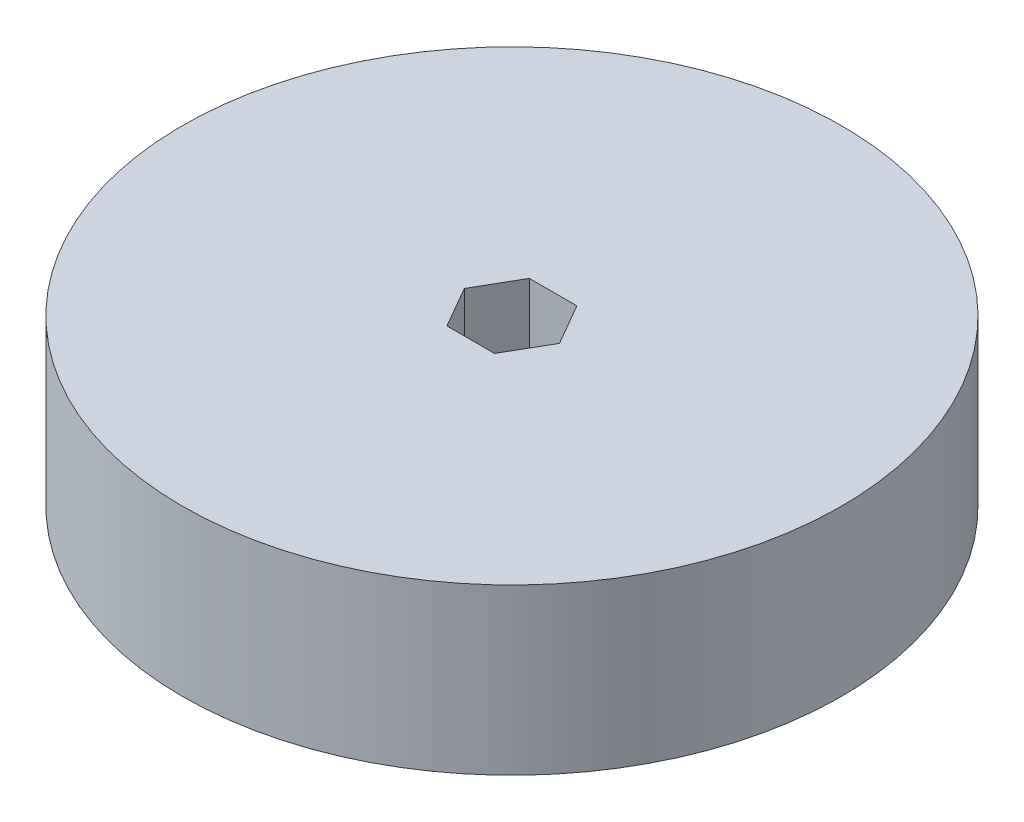
ISO-10303-21;
HEADER;
FILE_DESCRIPTION(('STEP AP214'),'2;1');
FILE_NAME('part.step','',(''),(''),'','','');
FILE_SCHEMA(('AUTOMOTIVE_DESIGN { 1 0 10303 214 1 1 1 1 }'));
ENDSEC;
DATA;
#1=APPLICATION_CONTEXT('core data for automotive mechanical design processes');
#2=APPLICATION_PROTOCOL_DEFINITION('international standard','automotive_design',2000,#1);
#3=PRODUCT_CONTEXT('',#1,'mechanical');
#4=PRODUCT('Part','Part','',(#3));
#5=PRODUCT_RELATED_PRODUCT_CATEGORY('part','',(#4));
#6=PRODUCT_DEFINITION_FORMATION('','',#4);
#7=PRODUCT_DEFINITION_CONTEXT('part definition',#1,'design');
#8=PRODUCT_DEFINITION('design','',#6,#7);
#9=PRODUCT_DEFINITION_SHAPE('','',#8);
#10=(LENGTH_UNIT() NAMED_UNIT(*) SI_UNIT(.MILLI.,.METRE.));
#11=(NAMED_UNIT(*) PLANE_ANGLE_UNIT() SI_UNIT($,.RADIAN.));
#12=(NAMED_UNIT(*) SI_UNIT($,.STERADIAN.) SOLID_ANGLE_UNIT());
#13=UNCERTAINTY_MEASURE_WITH_UNIT(LENGTH_MEASURE(1.E-05),#10,'distance_accuracy_value','');
#14=(GEOMETRIC_REPRESENTATION_CONTEXT(3) GLOBAL_UNCERTAINTY_ASSIGNED_CONTEXT((#13)) GLOBAL_UNIT_ASSIGNED_CONTEXT((#10,
#11,#12)) REPRESENTATION_CONTEXT('',''));
#15=CARTESIAN_POINT('',(0.,0.,0.));
#16=DIRECTION('',(0.,0.,1.));
#17=DIRECTION('',(1.,0.,0.));
#18=AXIS2_PLACEMENT_3D('',#15,#16,#17);
#19=CARTESIAN_POINT('',(0.,25.4,0.));
#20=DIRECTION('',(0.,1.,0.));
#21=DIRECTION('',(0.,0.,1.));
#22=AXIS2_PLACEMENT_3D('',#19,#20,#21);
#23=PLANE('',#22);
#24=CARTESIAN_POINT('',(0.,25.4,0.));
#25=DIRECTION('',(0.,1.,0.));
#26=DIRECTION('',(0.,0.,1.));
#27=AXIS2_PLACEMENT_3D('',#24,#25,#26);
#28=CIRCLE('',#27,50.8);
#29=CARTESIAN_POINT('',(0.,25.4,50.8));
#30=VERTEX_POINT('',#29);
#31=EDGE_CURVE('E11',#30,#30,#28,.T.);
#32=ORIENTED_EDGE('',*,*,#31,.T.);
#33=EDGE_LOOP('',(#32));
#34=FACE_BOUND('',#33,.T.);
#35=DIRECTION('',(-0.500000000000001,0.,-0.866025403784438));
#36=VECTOR('',#35,1.);
#37=CARTESIAN_POINT('',(7.33234841870825,25.4,0.));
#38=LINE('',#37,#36);
#39=CARTESIAN_POINT('',(7.33234841870825,25.4,0.));
#40=VERTEX_POINT('',#39);
#41=CARTESIAN_POINT('',(3.66617420935411,25.4,-6.35000000000001));
#42=VERTEX_POINT('',#41);
#43=EDGE_CURVE('E108',#40,#42,#38,.T.);
#44=ORIENTED_EDGE('',*,*,#43,.F.);
#45=DIRECTION('',(0.499999999999995,0.,-0.866025403784441));
#46=VECTOR('',#45,1.);
#47=CARTESIAN_POINT('',(3.6661742093542,25.4,6.34999999999996));
#48=LINE('',#47,#46);
#49=CARTESIAN_POINT('',(3.6661742093542,25.4,6.34999999999996));
#50=VERTEX_POINT('',#49);
#51=EDGE_CURVE('E99',#50,#40,#48,.T.);
#52=ORIENTED_EDGE('',*,*,#51,.F.);
#53=DIRECTION('',(1.,0.,0.));
#54=VECTOR('',#53,1.);
#55=CARTESIAN_POINT('',(-3.66617420935407,25.4,6.35000000000004));
#56=LINE('',#55,#54);
#57=CARTESIAN_POINT('',(-3.66617420935407,25.4,6.35000000000004));
#58=VERTEX_POINT('',#57);
#59=EDGE_CURVE('E133',#58,#50,#56,.T.);
#60=ORIENTED_EDGE('',*,*,#59,.F.);
#61=DIRECTION('',(0.500000000000007,0.,0.866025403784434));
#62=VECTOR('',#61,1.);
#63=CARTESIAN_POINT('',(-7.33234841870825,25.4,0.));
#64=LINE('',#63,#62);
#65=CARTESIAN_POINT('',(-7.33234841870825,25.4,0.));
#66=VERTEX_POINT('',#65);
#67=EDGE_CURVE('E130',#66,#58,#64,.T.);
#68=ORIENTED_EDGE('',*,*,#67,.F.);
#69=DIRECTION('',(-0.499999999999995,0.,0.866025403784442));
#70=VECTOR('',#69,1.);
#71=CARTESIAN_POINT('',(-3.66617420935416,25.4,-6.34999999999999));
#72=LINE('',#71,#70);
#73=CARTESIAN_POINT('',(-3.66617420935416,25.4,-6.34999999999999));
#74=VERTEX_POINT('',#73);
#75=EDGE_CURVE('E125',#74,#66,#72,.T.);
#76=ORIENTED_EDGE('',*,*,#75,.F.);
#77=DIRECTION('',(-1.,0.,0.));
#78=VECTOR('',#77,1.);
#79=CARTESIAN_POINT('',(3.66617420935411,25.4,-6.35000000000001));
#80=LINE('',#79,#78);
#81=EDGE_CURVE('E121',#42,#74,#80,.T.);
#82=ORIENTED_EDGE('',*,*,#81,.F.);
#83=EDGE_LOOP('',(#44,#52,#60,#68,#76,#82));
#84=FACE_BOUND('',#83,.T.);
#85=ADVANCED_FACE('F45',(#34,#84),#23,.T.);
#86=CARTESIAN_POINT('',(0.,0.,0.));
#87=DIRECTION('',(0.,1.,0.));
#88=DIRECTION('',(0.,0.,1.));
#89=AXIS2_PLACEMENT_3D('',#86,#87,#88);
#90=PLANE('',#89);
#91=CARTESIAN_POINT('',(0.,0.,0.));
#92=DIRECTION('',(0.,1.,0.));
#93=DIRECTION('',(0.,0.,1.));
#94=AXIS2_PLACEMENT_3D('',#91,#92,#93);
#95=CIRCLE('',#94,50.8);
#96=CARTESIAN_POINT('',(0.,0.,50.8));
#97=VERTEX_POINT('',#96);
#98=EDGE_CURVE('E49',#97,#97,#95,.T.);
#99=ORIENTED_EDGE('',*,*,#98,.F.);
#100=EDGE_LOOP('',(#99));
#101=FACE_BOUND('',#100,.T.);
#102=DIRECTION('',(0.499999999999995,0.,-0.866025403784441));
#103=VECTOR('',#102,1.);
#104=CARTESIAN_POINT('',(3.6661742093542,0.,6.34999999999996));
#105=LINE('',#104,#103);
#106=CARTESIAN_POINT('',(3.6661742093542,0.,6.34999999999996));
#107=VERTEX_POINT('',#106);
#108=CARTESIAN_POINT('',(7.33234841870825,0.,0.));
#109=VERTEX_POINT('',#108);
#110=EDGE_CURVE('E69',#107,#109,#105,.T.);
#111=ORIENTED_EDGE('',*,*,#110,.T.);
#112=DIRECTION('',(-0.500000000000001,0.,-0.866025403784438));
#113=VECTOR('',#112,1.);
#114=CARTESIAN_POINT('',(7.33234841870825,0.,0.));
#115=LINE('',#114,#113);
#116=CARTESIAN_POINT('',(3.66617420935411,0.,-6.35000000000001));
#117=VERTEX_POINT('',#116);
#118=EDGE_CURVE('E115',#109,#117,#115,.T.);
#119=ORIENTED_EDGE('',*,*,#118,.T.);
#120=DIRECTION('',(-1.,0.,0.));
#121=VECTOR('',#120,1.);
#122=CARTESIAN_POINT('',(3.66617420935411,0.,-6.35000000000001));
#123=LINE('',#122,#121);
#124=CARTESIAN_POINT('',(-3.66617420935416,0.,-6.34999999999999));
#125=VERTEX_POINT('',#124);
#126=EDGE_CURVE('E140',#117,#125,#123,.T.);
#127=ORIENTED_EDGE('',*,*,#126,.T.);
#128=DIRECTION('',(-0.499999999999995,0.,0.866025403784442));
#129=VECTOR('',#128,1.);
#130=CARTESIAN_POINT('',(-3.66617420935416,0.,-6.34999999999999));
#131=LINE('',#130,#129);
#132=CARTESIAN_POINT('',(-7.33234841870825,0.,0.));
#133=VERTEX_POINT('',#132);
#134=EDGE_CURVE('E144',#125,#133,#131,.T.);
#135=ORIENTED_EDGE('',*,*,#134,.T.);
#136=DIRECTION('',(0.500000000000007,0.,0.866025403784434));
#137=VECTOR('',#136,1.);
#138=CARTESIAN_POINT('',(-7.33234841870825,0.,0.));
#139=LINE('',#138,#137);
#140=CARTESIAN_POINT('',(-3.66617420935407,0.,6.35000000000004));
#141=VERTEX_POINT('',#140);
#142=EDGE_CURVE('E148',#133,#141,#139,.T.);
#143=ORIENTED_EDGE('',*,*,#142,.T.);
#144=DIRECTION('',(1.,0.,0.));
#145=VECTOR('',#144,1.);
#146=CARTESIAN_POINT('',(-3.66617420935407,0.,6.35000000000004));
#147=LINE('',#146,#145);
#148=EDGE_CURVE('E109',#141,#107,#147,.T.);
#149=ORIENTED_EDGE('',*,*,#148,.T.);
#150=EDGE_LOOP('',(#111,#119,#127,#135,#143,#149));
#151=FACE_BOUND('',#150,.T.);
#152=ADVANCED_FACE('F172',(#101,#151),#90,.F.);
#153=CARTESIAN_POINT('',(0.,25.4,0.));
#154=DIRECTION('',(0.,-1.,0.));
#155=DIRECTION('',(0.,0.,-1.));
#156=AXIS2_PLACEMENT_3D('',#153,#154,#155);
#157=CYLINDRICAL_SURFACE('',#156,50.8);
#158=ORIENTED_EDGE('',*,*,#31,.F.);
#159=EDGE_LOOP('',(#158));
#160=FACE_BOUND('',#159,.T.);
#161=ORIENTED_EDGE('',*,*,#98,.T.);
#162=EDGE_LOOP('',(#161));
#163=FACE_BOUND('',#162,.T.);
#164=ADVANCED_FACE('F47',(#160,#163),#157,.T.);
#165=CARTESIAN_POINT('',(3.6661742093542,25.4,6.34999999999996));
#166=DIRECTION('',(-0.866025403784441,0.,-0.499999999999995));
#167=DIRECTION('',(-0.499999999999995,0.,0.866025403784441));
#168=AXIS2_PLACEMENT_3D('',#165,#166,#167);
#169=PLANE('',#168);
#170=ORIENTED_EDGE('',*,*,#110,.F.);
#171=DIRECTION('',(0.,-1.,0.));
#172=VECTOR('',#171,1.);
#173=CARTESIAN_POINT('',(3.6661742093542,25.4,6.34999999999996));
#174=LINE('',#173,#172);
#175=EDGE_CURVE('E103',#50,#107,#174,.T.);
#176=ORIENTED_EDGE('',*,*,#175,.F.);
#177=ORIENTED_EDGE('',*,*,#51,.T.);
#178=DIRECTION('',(0.,-1.,0.));
#179=VECTOR('',#178,1.);
#180=CARTESIAN_POINT('',(7.33234841870825,25.4,0.));
#181=LINE('',#180,#179);
#182=EDGE_CURVE('E102',#40,#109,#181,.T.);
#183=ORIENTED_EDGE('',*,*,#182,.T.);
#184=EDGE_LOOP('',(#170,#176,#177,#183));
#185=FACE_BOUND('',#184,.T.);
#186=ADVANCED_FACE('F101',(#185),#169,.T.);
#187=CARTESIAN_POINT('',(7.33234841870825,25.4,0.));
#188=DIRECTION('',(-0.866025403784438,0.,0.500000000000001));
#189=DIRECTION('',(0.500000000000001,0.,0.866025403784438));
#190=AXIS2_PLACEMENT_3D('',#187,#188,#189);
#191=PLANE('',#190);
#192=ORIENTED_EDGE('',*,*,#118,.F.);
#193=ORIENTED_EDGE('',*,*,#182,.F.);
#194=ORIENTED_EDGE('',*,*,#43,.T.);
#195=DIRECTION('',(0.,-1.,0.));
#196=VECTOR('',#195,1.);
#197=CARTESIAN_POINT('',(3.66617420935411,25.4,-6.35000000000001));
#198=LINE('',#197,#196);
#199=EDGE_CURVE('E117',#42,#117,#198,.T.);
#200=ORIENTED_EDGE('',*,*,#199,.T.);
#201=EDGE_LOOP('',(#192,#193,#194,#200));
#202=FACE_BOUND('',#201,.T.);
#203=ADVANCED_FACE('F112',(#202),#191,.T.);
#204=CARTESIAN_POINT('',(3.66617420935411,25.4,-6.35000000000001));
#205=DIRECTION('',(0.,0.,1.));
#206=DIRECTION('',(1.,0.,0.));
#207=AXIS2_PLACEMENT_3D('',#204,#205,#206);
#208=PLANE('',#207);
#209=ORIENTED_EDGE('',*,*,#126,.F.);
#210=ORIENTED_EDGE('',*,*,#199,.F.);
#211=ORIENTED_EDGE('',*,*,#81,.T.);
#212=DIRECTION('',(0.,-1.,0.));
#213=VECTOR('',#212,1.);
#214=CARTESIAN_POINT('',(-3.66617420935416,25.4,-6.34999999999999));
#215=LINE('',#214,#213);
#216=EDGE_CURVE('E162',#74,#125,#215,.T.);
#217=ORIENTED_EDGE('',*,*,#216,.T.);
#218=EDGE_LOOP('',(#209,#210,#211,#217));
#219=FACE_BOUND('',#218,.T.);
#220=ADVANCED_FACE('F168',(#219),#208,.T.);
#221=CARTESIAN_POINT('',(-3.66617420935416,25.4,-6.34999999999999));
#222=DIRECTION('',(0.866025403784442,0.,0.499999999999995));
#223=DIRECTION('',(0.499999999999995,0.,-0.866025403784442));
#224=AXIS2_PLACEMENT_3D('',#221,#222,#223);
#225=PLANE('',#224);
#226=ORIENTED_EDGE('',*,*,#134,.F.);
#227=ORIENTED_EDGE('',*,*,#216,.F.);
#228=ORIENTED_EDGE('',*,*,#75,.T.);
#229=DIRECTION('',(0.,-1.,0.));
#230=VECTOR('',#229,1.);
#231=CARTESIAN_POINT('',(-7.33234841870825,25.4,0.));
#232=LINE('',#231,#230);
#233=EDGE_CURVE('E159',#66,#133,#232,.T.);
#234=ORIENTED_EDGE('',*,*,#233,.T.);
#235=EDGE_LOOP('',(#226,#227,#228,#234));
#236=FACE_BOUND('',#235,.T.);
#237=ADVANCED_FACE('F180',(#236),#225,.T.);
#238=CARTESIAN_POINT('',(-7.33234841870825,25.4,0.));
#239=DIRECTION('',(0.866025403784434,0.,-0.500000000000007));
#240=DIRECTION('',(-0.500000000000007,0.,-0.866025403784435));
#241=AXIS2_PLACEMENT_3D('',#238,#239,#240);
#242=PLANE('',#241);
#243=ORIENTED_EDGE('',*,*,#142,.F.);
#244=ORIENTED_EDGE('',*,*,#233,.F.);
#245=ORIENTED_EDGE('',*,*,#67,.T.);
#246=DIRECTION('',(0.,-1.,0.));
#247=VECTOR('',#246,1.);
#248=CARTESIAN_POINT('',(-3.66617420935407,25.4,6.35000000000004));
#249=LINE('',#248,#247);
#250=EDGE_CURVE('E61',#58,#141,#249,.T.);
#251=ORIENTED_EDGE('',*,*,#250,.T.);
#252=EDGE_LOOP('',(#243,#244,#245,#251));
#253=FACE_BOUND('',#252,.T.);
#254=ADVANCED_FACE('F178',(#253),#242,.T.);
#255=CARTESIAN_POINT('',(-3.66617420935407,25.4,6.35000000000004));
#256=DIRECTION('',(0.,0.,-1.));
#257=DIRECTION('',(-1.,0.,0.));
#258=AXIS2_PLACEMENT_3D('',#255,#256,#257);
#259=PLANE('',#258);
#260=ORIENTED_EDGE('',*,*,#148,.F.);
#261=ORIENTED_EDGE('',*,*,#250,.F.);
#262=ORIENTED_EDGE('',*,*,#59,.T.);
#263=ORIENTED_EDGE('',*,*,#175,.T.);
#264=EDGE_LOOP('',(#260,#261,#262,#263));
#265=FACE_BOUND('',#264,.T.);
#266=ADVANCED_FACE('F174',(#265),#259,.T.);
#267=CLOSED_SHELL('',(#85,#152,#164,#186,#203,#220,#237,#254,#266));
#268=MANIFOLD_SOLID_BREP('B2',#267);
#269=ADVANCED_BREP_SHAPE_REPRESENTATION('',(#18,#268),#14);
#270=SHAPE_DEFINITION_REPRESENTATION(#9,#269);
ENDSEC;
END-ISO-10303-21;
